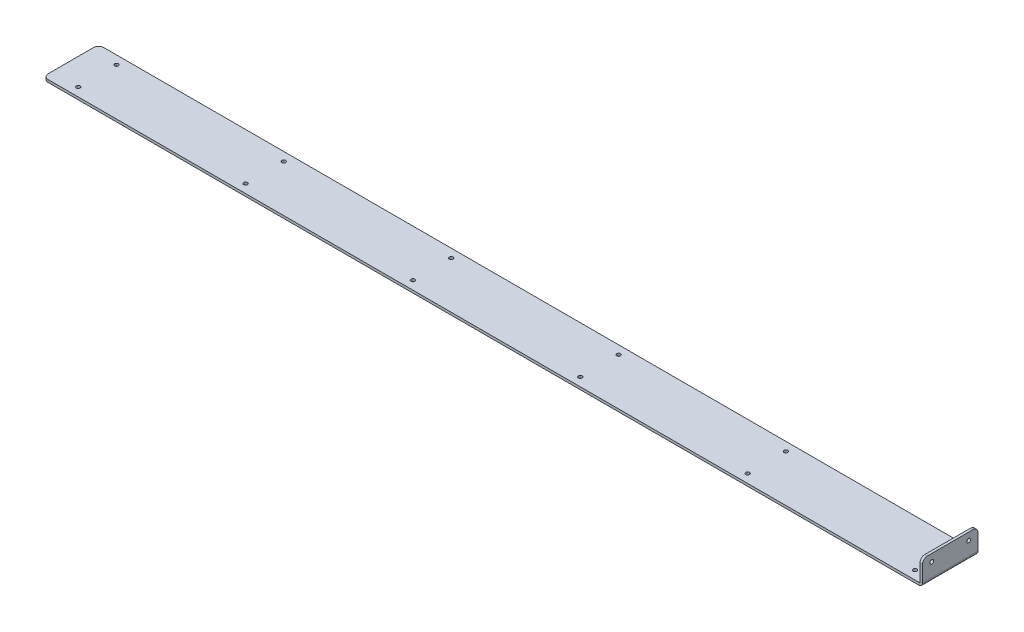
ISO-10303-21;
HEADER;
FILE_DESCRIPTION(('STEP AP214'),'2;1');
FILE_NAME('part.step','',(''),(''),'','','');
FILE_SCHEMA(('AUTOMOTIVE_DESIGN { 1 0 10303 214 1 1 1 1 }'));
ENDSEC;
DATA;
#1=APPLICATION_CONTEXT('core data for automotive mechanical design processes');
#2=APPLICATION_PROTOCOL_DEFINITION('international standard','automotive_design',2000,#1);
#3=PRODUCT_CONTEXT('',#1,'mechanical');
#4=PRODUCT('Part','Part','',(#3));
#5=PRODUCT_RELATED_PRODUCT_CATEGORY('part','',(#4));
#6=PRODUCT_DEFINITION_FORMATION('','',#4);
#7=PRODUCT_DEFINITION_CONTEXT('part definition',#1,'design');
#8=PRODUCT_DEFINITION('design','',#6,#7);
#9=PRODUCT_DEFINITION_SHAPE('','',#8);
#10=(LENGTH_UNIT() NAMED_UNIT(*) SI_UNIT(.MILLI.,.METRE.));
#11=(NAMED_UNIT(*) PLANE_ANGLE_UNIT() SI_UNIT($,.RADIAN.));
#12=(NAMED_UNIT(*) SI_UNIT($,.STERADIAN.) SOLID_ANGLE_UNIT());
#13=UNCERTAINTY_MEASURE_WITH_UNIT(LENGTH_MEASURE(1.E-05),#10,'distance_accuracy_value','');
#14=(GEOMETRIC_REPRESENTATION_CONTEXT(3) GLOBAL_UNCERTAINTY_ASSIGNED_CONTEXT((#13)) GLOBAL_UNIT_ASSIGNED_CONTEXT((#10,
#11,#12)) REPRESENTATION_CONTEXT('',''));
#15=CARTESIAN_POINT('',(0.,0.,0.));
#16=DIRECTION('',(0.,0.,1.));
#17=DIRECTION('',(1.,0.,0.));
#18=AXIS2_PLACEMENT_3D('',#15,#16,#17);
#19=CARTESIAN_POINT('',(-1092.4286,0.,24.6062500000007));
#20=DIRECTION('',(0.,1.,0.));
#21=DIRECTION('',(0.,0.,1.));
#22=AXIS2_PLACEMENT_3D('',#19,#20,#21);
#23=CYLINDRICAL_SURFACE('',#22,2.45744999999999);
#24=CARTESIAN_POINT('',(-1092.4286,-3.2639,24.6062500000007));
#25=DIRECTION('',(0.,1.,0.));
#26=DIRECTION('',(0.,0.,1.));
#27=AXIS2_PLACEMENT_3D('',#24,#25,#26);
#28=CIRCLE('',#27,2.45744999999999);
#29=CARTESIAN_POINT('',(-1092.4286,-3.2639,27.0637000000007));
#30=VERTEX_POINT('',#29);
#31=EDGE_CURVE('E274',#30,#30,#28,.T.);
#32=ORIENTED_EDGE('',*,*,#31,.F.);
#33=EDGE_LOOP('',(#32));
#34=FACE_BOUND('',#33,.T.);
#35=CARTESIAN_POINT('',(-1092.4286,0.,24.6062500000007));
#36=DIRECTION('',(0.,1.,0.));
#37=DIRECTION('',(0.,0.,1.));
#38=AXIS2_PLACEMENT_3D('',#35,#36,#37);
#39=CIRCLE('',#38,2.45744999999999);
#40=CARTESIAN_POINT('',(-1092.4286,0.,27.0637000000006));
#41=VERTEX_POINT('',#40);
#42=EDGE_CURVE('E277',#41,#41,#39,.T.);
#43=ORIENTED_EDGE('',*,*,#42,.T.);
#44=EDGE_LOOP('',(#43));
#45=FACE_BOUND('',#44,.T.);
#46=ADVANCED_FACE('F58',(#34,#45),#23,.F.);
#47=CARTESIAN_POINT('',(-877.1636,0.,24.6062500000005));
#48=DIRECTION('',(0.,1.,0.));
#49=DIRECTION('',(0.,0.,1.));
#50=AXIS2_PLACEMENT_3D('',#47,#48,#49);
#51=CYLINDRICAL_SURFACE('',#50,2.45744999999999);
#52=CARTESIAN_POINT('',(-877.1636,-3.2639,24.6062500000005));
#53=DIRECTION('',(0.,1.,0.));
#54=DIRECTION('',(0.,0.,1.));
#55=AXIS2_PLACEMENT_3D('',#52,#53,#54);
#56=CIRCLE('',#55,2.45744999999999);
#57=CARTESIAN_POINT('',(-877.1636,-3.2639,27.0637000000005));
#58=VERTEX_POINT('',#57);
#59=EDGE_CURVE('E268',#58,#58,#56,.T.);
#60=ORIENTED_EDGE('',*,*,#59,.F.);
#61=EDGE_LOOP('',(#60));
#62=FACE_BOUND('',#61,.T.);
#63=CARTESIAN_POINT('',(-877.1636,0.,24.6062500000005));
#64=DIRECTION('',(0.,1.,0.));
#65=DIRECTION('',(0.,0.,1.));
#66=AXIS2_PLACEMENT_3D('',#63,#64,#65);
#67=CIRCLE('',#66,2.45744999999999);
#68=CARTESIAN_POINT('',(-877.1636,0.,27.0637000000005));
#69=VERTEX_POINT('',#68);
#70=EDGE_CURVE('E271',#69,#69,#67,.T.);
#71=ORIENTED_EDGE('',*,*,#70,.T.);
#72=EDGE_LOOP('',(#71));
#73=FACE_BOUND('',#72,.T.);
#74=ADVANCED_FACE('F361',(#62,#73),#51,.F.);
#75=CARTESIAN_POINT('',(-661.8986,0.,24.6062500000004));
#76=DIRECTION('',(0.,1.,0.));
#77=DIRECTION('',(0.,0.,1.));
#78=AXIS2_PLACEMENT_3D('',#75,#76,#77);
#79=CYLINDRICAL_SURFACE('',#78,2.45744999999999);
#80=CARTESIAN_POINT('',(-661.8986,-3.2639,24.6062500000004));
#81=DIRECTION('',(0.,1.,0.));
#82=DIRECTION('',(0.,0.,1.));
#83=AXIS2_PLACEMENT_3D('',#80,#81,#82);
#84=CIRCLE('',#83,2.45744999999999);
#85=CARTESIAN_POINT('',(-661.8986,-3.2639,27.0637000000004));
#86=VERTEX_POINT('',#85);
#87=EDGE_CURVE('E262',#86,#86,#84,.T.);
#88=ORIENTED_EDGE('',*,*,#87,.F.);
#89=EDGE_LOOP('',(#88));
#90=FACE_BOUND('',#89,.T.);
#91=CARTESIAN_POINT('',(-661.8986,0.,24.6062500000004));
#92=DIRECTION('',(0.,1.,0.));
#93=DIRECTION('',(0.,0.,1.));
#94=AXIS2_PLACEMENT_3D('',#91,#92,#93);
#95=CIRCLE('',#94,2.45744999999999);
#96=CARTESIAN_POINT('',(-661.8986,0.,27.0637000000004));
#97=VERTEX_POINT('',#96);
#98=EDGE_CURVE('E265',#97,#97,#95,.T.);
#99=ORIENTED_EDGE('',*,*,#98,.T.);
#100=EDGE_LOOP('',(#99));
#101=FACE_BOUND('',#100,.T.);
#102=ADVANCED_FACE('F366',(#90,#101),#79,.F.);
#103=CARTESIAN_POINT('',(-446.6336,0.,24.6062500000003));
#104=DIRECTION('',(0.,1.,0.));
#105=DIRECTION('',(0.,0.,1.));
#106=AXIS2_PLACEMENT_3D('',#103,#104,#105);
#107=CYLINDRICAL_SURFACE('',#106,2.45744999999999);
#108=CARTESIAN_POINT('',(-446.6336,-3.2639,24.6062500000003));
#109=DIRECTION('',(0.,1.,0.));
#110=DIRECTION('',(0.,0.,1.));
#111=AXIS2_PLACEMENT_3D('',#108,#109,#110);
#112=CIRCLE('',#111,2.45744999999999);
#113=CARTESIAN_POINT('',(-446.6336,-3.2639,27.0637000000003));
#114=VERTEX_POINT('',#113);
#115=EDGE_CURVE('E256',#114,#114,#112,.T.);
#116=ORIENTED_EDGE('',*,*,#115,.F.);
#117=EDGE_LOOP('',(#116));
#118=FACE_BOUND('',#117,.T.);
#119=CARTESIAN_POINT('',(-446.6336,0.,24.6062500000003));
#120=DIRECTION('',(0.,1.,0.));
#121=DIRECTION('',(0.,0.,1.));
#122=AXIS2_PLACEMENT_3D('',#119,#120,#121);
#123=CIRCLE('',#122,2.45744999999999);
#124=CARTESIAN_POINT('',(-446.6336,0.,27.0637000000003));
#125=VERTEX_POINT('',#124);
#126=EDGE_CURVE('E259',#125,#125,#123,.T.);
#127=ORIENTED_EDGE('',*,*,#126,.T.);
#128=EDGE_LOOP('',(#127));
#129=FACE_BOUND('',#128,.T.);
#130=ADVANCED_FACE('F374',(#118,#129),#107,.F.);
#131=CARTESIAN_POINT('',(-1092.4286,0.,-24.6062499999993));
#132=DIRECTION('',(0.,1.,0.));
#133=DIRECTION('',(0.,0.,1.));
#134=AXIS2_PLACEMENT_3D('',#131,#132,#133);
#135=CYLINDRICAL_SURFACE('',#134,2.45744999999999);
#136=CARTESIAN_POINT('',(-1092.4286,-3.2639,-24.6062499999993));
#137=DIRECTION('',(0.,1.,0.));
#138=DIRECTION('',(0.,0.,1.));
#139=AXIS2_PLACEMENT_3D('',#136,#137,#138);
#140=CIRCLE('',#139,2.45744999999999);
#141=CARTESIAN_POINT('',(-1092.4286,-3.2639,-22.1487999999993));
#142=VERTEX_POINT('',#141);
#143=EDGE_CURVE('E250',#142,#142,#140,.T.);
#144=ORIENTED_EDGE('',*,*,#143,.F.);
#145=EDGE_LOOP('',(#144));
#146=FACE_BOUND('',#145,.T.);
#147=CARTESIAN_POINT('',(-1092.4286,0.,-24.6062499999993));
#148=DIRECTION('',(0.,1.,0.));
#149=DIRECTION('',(0.,0.,1.));
#150=AXIS2_PLACEMENT_3D('',#147,#148,#149);
#151=CIRCLE('',#150,2.45744999999999);
#152=CARTESIAN_POINT('',(-1092.4286,0.,-22.1487999999994));
#153=VERTEX_POINT('',#152);
#154=EDGE_CURVE('E253',#153,#153,#151,.T.);
#155=ORIENTED_EDGE('',*,*,#154,.T.);
#156=EDGE_LOOP('',(#155));
#157=FACE_BOUND('',#156,.T.);
#158=ADVANCED_FACE('F378',(#146,#157),#135,.F.);
#159=CARTESIAN_POINT('',(-877.1636,0.,-24.6062499999995));
#160=DIRECTION('',(0.,1.,0.));
#161=DIRECTION('',(0.,0.,1.));
#162=AXIS2_PLACEMENT_3D('',#159,#160,#161);
#163=CYLINDRICAL_SURFACE('',#162,2.45744999999999);
#164=CARTESIAN_POINT('',(-877.1636,-3.2639,-24.6062499999995));
#165=DIRECTION('',(0.,1.,0.));
#166=DIRECTION('',(0.,0.,1.));
#167=AXIS2_PLACEMENT_3D('',#164,#165,#166);
#168=CIRCLE('',#167,2.45744999999999);
#169=CARTESIAN_POINT('',(-877.1636,-3.2639,-22.1487999999995));
#170=VERTEX_POINT('',#169);
#171=EDGE_CURVE('E244',#170,#170,#168,.T.);
#172=ORIENTED_EDGE('',*,*,#171,.F.);
#173=EDGE_LOOP('',(#172));
#174=FACE_BOUND('',#173,.T.);
#175=CARTESIAN_POINT('',(-877.1636,0.,-24.6062499999995));
#176=DIRECTION('',(0.,1.,0.));
#177=DIRECTION('',(0.,0.,1.));
#178=AXIS2_PLACEMENT_3D('',#175,#176,#177);
#179=CIRCLE('',#178,2.45744999999999);
#180=CARTESIAN_POINT('',(-877.1636,0.,-22.1487999999995));
#181=VERTEX_POINT('',#180);
#182=EDGE_CURVE('E247',#181,#181,#179,.T.);
#183=ORIENTED_EDGE('',*,*,#182,.T.);
#184=EDGE_LOOP('',(#183));
#185=FACE_BOUND('',#184,.T.);
#186=ADVANCED_FACE('F382',(#174,#185),#163,.F.);
#187=CARTESIAN_POINT('',(-661.8986,0.,-24.6062499999996));
#188=DIRECTION('',(0.,1.,0.));
#189=DIRECTION('',(0.,0.,1.));
#190=AXIS2_PLACEMENT_3D('',#187,#188,#189);
#191=CYLINDRICAL_SURFACE('',#190,2.45744999999999);
#192=CARTESIAN_POINT('',(-661.8986,-3.2639,-24.6062499999996));
#193=DIRECTION('',(0.,1.,0.));
#194=DIRECTION('',(0.,0.,1.));
#195=AXIS2_PLACEMENT_3D('',#192,#193,#194);
#196=CIRCLE('',#195,2.45744999999999);
#197=CARTESIAN_POINT('',(-661.8986,-3.2639,-22.1487999999996));
#198=VERTEX_POINT('',#197);
#199=EDGE_CURVE('E238',#198,#198,#196,.T.);
#200=ORIENTED_EDGE('',*,*,#199,.F.);
#201=EDGE_LOOP('',(#200));
#202=FACE_BOUND('',#201,.T.);
#203=CARTESIAN_POINT('',(-661.8986,0.,-24.6062499999996));
#204=DIRECTION('',(0.,1.,0.));
#205=DIRECTION('',(0.,0.,1.));
#206=AXIS2_PLACEMENT_3D('',#203,#204,#205);
#207=CIRCLE('',#206,2.45744999999999);
#208=CARTESIAN_POINT('',(-661.8986,0.,-22.1487999999996));
#209=VERTEX_POINT('',#208);
#210=EDGE_CURVE('E241',#209,#209,#207,.T.);
#211=ORIENTED_EDGE('',*,*,#210,.T.);
#212=EDGE_LOOP('',(#211));
#213=FACE_BOUND('',#212,.T.);
#214=ADVANCED_FACE('F386',(#202,#213),#191,.F.);
#215=CARTESIAN_POINT('',(-446.6336,0.,-24.6062499999997));
#216=DIRECTION('',(0.,1.,0.));
#217=DIRECTION('',(0.,0.,1.));
#218=AXIS2_PLACEMENT_3D('',#215,#216,#217);
#219=CYLINDRICAL_SURFACE('',#218,2.45744999999999);
#220=CARTESIAN_POINT('',(-446.6336,-3.2639,-24.6062499999997));
#221=DIRECTION('',(0.,1.,0.));
#222=DIRECTION('',(0.,0.,1.));
#223=AXIS2_PLACEMENT_3D('',#220,#221,#222);
#224=CIRCLE('',#223,2.45744999999999);
#225=CARTESIAN_POINT('',(-446.6336,-3.2639,-22.1487999999997));
#226=VERTEX_POINT('',#225);
#227=EDGE_CURVE('E230',#226,#226,#224,.T.);
#228=ORIENTED_EDGE('',*,*,#227,.F.);
#229=EDGE_LOOP('',(#228));
#230=FACE_BOUND('',#229,.T.);
#231=CARTESIAN_POINT('',(-446.6336,0.,-24.6062499999997));
#232=DIRECTION('',(0.,1.,0.));
#233=DIRECTION('',(0.,0.,1.));
#234=AXIS2_PLACEMENT_3D('',#231,#232,#233);
#235=CIRCLE('',#234,2.45744999999999);
#236=CARTESIAN_POINT('',(-446.6336,0.,-22.1487999999997));
#237=VERTEX_POINT('',#236);
#238=EDGE_CURVE('E235',#237,#237,#235,.T.);
#239=ORIENTED_EDGE('',*,*,#238,.T.);
#240=EDGE_LOOP('',(#239));
#241=FACE_BOUND('',#240,.T.);
#242=ADVANCED_FACE('F390',(#230,#241),#219,.F.);
#243=CARTESIAN_POINT('',(-1126.47095,-3.2639,-35.7187499999993));
#244=DIRECTION('',(-1.,0.,0.));
#245=DIRECTION('',(0.,0.,1.));
#246=AXIS2_PLACEMENT_3D('',#243,#244,#245);
#247=PLANE('',#246);
#248=DIRECTION('',(0.,0.,1.));
#249=VECTOR('',#248,1.);
#250=CARTESIAN_POINT('',(-1126.47095,-3.2639,-35.7187499999993));
#251=LINE('',#250,#249);
#252=CARTESIAN_POINT('',(-1126.47095,-3.2639,-29.3687499999993));
#253=VERTEX_POINT('',#252);
#254=CARTESIAN_POINT('',(-1126.47095,-3.2639,29.36875));
#255=VERTEX_POINT('',#254);
#256=EDGE_CURVE('E210',#253,#255,#251,.T.);
#257=ORIENTED_EDGE('',*,*,#256,.T.);
#258=DIRECTION('',(0.,1.,0.));
#259=VECTOR('',#258,1.);
#260=CARTESIAN_POINT('',(-1126.47095,-3.2639,29.36875));
#261=LINE('',#260,#259);
#262=CARTESIAN_POINT('',(-1126.47095,0.,29.36875));
#263=VERTEX_POINT('',#262);
#264=EDGE_CURVE('E299',#255,#263,#261,.T.);
#265=ORIENTED_EDGE('',*,*,#264,.T.);
#266=DIRECTION('',(0.,0.,1.));
#267=VECTOR('',#266,1.);
#268=CARTESIAN_POINT('',(-1126.47095,0.,-35.7187499999993));
#269=LINE('',#268,#267);
#270=CARTESIAN_POINT('',(-1126.47095,0.,-29.3687499999993));
#271=VERTEX_POINT('',#270);
#272=EDGE_CURVE('E205',#271,#263,#269,.T.);
#273=ORIENTED_EDGE('',*,*,#272,.F.);
#274=DIRECTION('',(0.,1.,0.));
#275=VECTOR('',#274,1.);
#276=CARTESIAN_POINT('',(-1126.47095,-3.2639,-29.3687499999993));
#277=LINE('',#276,#275);
#278=EDGE_CURVE('E297',#271,#253,#277,.F.);
#279=ORIENTED_EDGE('',*,*,#278,.T.);
#280=EDGE_LOOP('',(#257,#265,#273,#279));
#281=FACE_BOUND('',#280,.T.);
#282=ADVANCED_FACE('F313',(#281),#247,.T.);
#283=CARTESIAN_POINT('',(-1126.47095,-3.2639,-35.7187499999993));
#284=DIRECTION('',(0.,0.,-1.));
#285=DIRECTION('',(-1.,0.,0.));
#286=AXIS2_PLACEMENT_3D('',#283,#284,#285);
#287=PLANE('',#286);
#288=DIRECTION('',(-1.,0.,0.));
#289=VECTOR('',#288,1.);
#290=CARTESIAN_POINT('',(-1126.47095,-3.2639,-35.7187499999993));
#291=LINE('',#290,#289);
#292=CARTESIAN_POINT('',(0.,-3.2639,-35.71875));
#293=VERTEX_POINT('',#292);
#294=CARTESIAN_POINT('',(-1120.12095,-3.2639,-35.7187499999993));
#295=VERTEX_POINT('',#294);
#296=EDGE_CURVE('E217',#293,#295,#291,.T.);
#297=ORIENTED_EDGE('',*,*,#296,.T.);
#298=DIRECTION('',(0.,1.,0.));
#299=VECTOR('',#298,1.);
#300=CARTESIAN_POINT('',(-1120.12095,-3.2639,-35.7187499999993));
#301=LINE('',#300,#299);
#302=CARTESIAN_POINT('',(-1120.12095,0.,-35.7187499999993));
#303=VERTEX_POINT('',#302);
#304=EDGE_CURVE('E13',#295,#303,#301,.T.);
#305=ORIENTED_EDGE('',*,*,#304,.T.);
#306=DIRECTION('',(-1.,0.,0.));
#307=VECTOR('',#306,1.);
#308=CARTESIAN_POINT('',(-1126.47095,0.,-35.7187499999993));
#309=LINE('',#308,#307);
#310=CARTESIAN_POINT('',(0.,0.,-35.71875));
#311=VERTEX_POINT('',#310);
#312=EDGE_CURVE('E214',#311,#303,#309,.T.);
#313=ORIENTED_EDGE('',*,*,#312,.F.);
#314=DIRECTION('',(0.,1.,0.));
#315=VECTOR('',#314,1.);
#316=CARTESIAN_POINT('',(0.,-3.2639,-35.71875));
#317=LINE('',#316,#315);
#318=EDGE_CURVE('E228',#293,#311,#317,.T.);
#319=ORIENTED_EDGE('',*,*,#318,.F.);
#320=EDGE_LOOP('',(#297,#305,#313,#319));
#321=FACE_BOUND('',#320,.T.);
#322=ADVANCED_FACE('F397',(#321),#287,.T.);
#323=CARTESIAN_POINT('',(-1126.47095,-3.2639,35.71875));
#324=DIRECTION('',(0.,0.,1.));
#325=DIRECTION('',(1.,0.,0.));
#326=AXIS2_PLACEMENT_3D('',#323,#324,#325);
#327=PLANE('',#326);
#328=DIRECTION('',(1.,0.,0.));
#329=VECTOR('',#328,1.);
#330=CARTESIAN_POINT('',(-1126.47095,0.,35.71875));
#331=LINE('',#330,#329);
#332=CARTESIAN_POINT('',(-1120.12095,0.,35.71875));
#333=VERTEX_POINT('',#332);
#334=CARTESIAN_POINT('',(0.,0.,35.71875));
#335=VERTEX_POINT('',#334);
#336=EDGE_CURVE('E222',#333,#335,#331,.T.);
#337=ORIENTED_EDGE('',*,*,#336,.F.);
#338=DIRECTION('',(0.,1.,0.));
#339=VECTOR('',#338,1.);
#340=CARTESIAN_POINT('',(-1120.12095,-3.2639,35.71875));
#341=LINE('',#340,#339);
#342=CARTESIAN_POINT('',(-1120.12095,-3.2639,35.71875));
#343=VERTEX_POINT('',#342);
#344=EDGE_CURVE('E81',#333,#343,#341,.F.);
#345=ORIENTED_EDGE('',*,*,#344,.T.);
#346=DIRECTION('',(1.,0.,0.));
#347=VECTOR('',#346,1.);
#348=CARTESIAN_POINT('',(-1126.47095,-3.2639,35.71875));
#349=LINE('',#348,#347);
#350=CARTESIAN_POINT('',(0.,-3.2639,35.71875));
#351=VERTEX_POINT('',#350);
#352=EDGE_CURVE('E213',#343,#351,#349,.T.);
#353=ORIENTED_EDGE('',*,*,#352,.T.);
#354=DIRECTION('',(0.,1.,0.));
#355=VECTOR('',#354,1.);
#356=CARTESIAN_POINT('',(0.,-3.2639,35.71875));
#357=LINE('',#356,#355);
#358=EDGE_CURVE('E219',#351,#335,#357,.T.);
#359=ORIENTED_EDGE('',*,*,#358,.T.);
#360=EDGE_LOOP('',(#337,#345,#353,#359));
#361=FACE_BOUND('',#360,.T.);
#362=ADVANCED_FACE('F320',(#361),#327,.T.);
#363=CARTESIAN_POINT('',(0.,-3.2639,0.));
#364=DIRECTION('',(0.,1.,0.));
#365=DIRECTION('',(0.,0.,1.));
#366=AXIS2_PLACEMENT_3D('',#363,#364,#365);
#367=PLANE('',#366);
#368=CARTESIAN_POINT('',(-231.3686,-3.2639,24.6062500000001));
#369=DIRECTION('',(0.,1.,0.));
#370=DIRECTION('',(0.,0.,1.));
#371=AXIS2_PLACEMENT_3D('',#368,#369,#370);
#372=CIRCLE('',#371,2.45744999999999);
#373=CARTESIAN_POINT('',(-231.3686,-3.2639,27.0637000000001));
#374=VERTEX_POINT('',#373);
#375=EDGE_CURVE('E459',#374,#374,#372,.T.);
#376=ORIENTED_EDGE('',*,*,#375,.T.);
#377=EDGE_LOOP('',(#376));
#378=FACE_BOUND('',#377,.T.);
#379=CARTESIAN_POINT('',(-231.3686,-3.2639,-24.6062499999999));
#380=DIRECTION('',(0.,1.,0.));
#381=DIRECTION('',(0.,0.,1.));
#382=AXIS2_PLACEMENT_3D('',#379,#380,#381);
#383=CIRCLE('',#382,2.45744999999999);
#384=CARTESIAN_POINT('',(-231.3686,-3.2639,-22.1487999999999));
#385=VERTEX_POINT('',#384);
#386=EDGE_CURVE('E471',#385,#385,#383,.T.);
#387=ORIENTED_EDGE('',*,*,#386,.T.);
#388=EDGE_LOOP('',(#387));
#389=FACE_BOUND('',#388,.T.);
#390=CARTESIAN_POINT('',(-16.1035999999999,-3.2639,-24.60625));
#391=DIRECTION('',(0.,1.,0.));
#392=DIRECTION('',(0.,0.,1.));
#393=AXIS2_PLACEMENT_3D('',#390,#391,#392);
#394=CIRCLE('',#393,2.45744999999999);
#395=CARTESIAN_POINT('',(-16.1035999999999,-3.2639,-22.1488));
#396=VERTEX_POINT('',#395);
#397=EDGE_CURVE('E480',#396,#396,#394,.T.);
#398=ORIENTED_EDGE('',*,*,#397,.T.);
#399=EDGE_LOOP('',(#398));
#400=FACE_BOUND('',#399,.T.);
#401=CARTESIAN_POINT('',(-16.1035999999999,-3.2639,24.60625));
#402=DIRECTION('',(0.,1.,0.));
#403=DIRECTION('',(0.,0.,1.));
#404=AXIS2_PLACEMENT_3D('',#401,#402,#403);
#405=CIRCLE('',#404,2.45744999999999);
#406=CARTESIAN_POINT('',(-16.1035999999999,-3.2639,27.0637));
#407=VERTEX_POINT('',#406);
#408=EDGE_CURVE('E204',#407,#407,#405,.T.);
#409=ORIENTED_EDGE('',*,*,#408,.T.);
#410=EDGE_LOOP('',(#409));
#411=FACE_BOUND('',#410,.T.);
#412=ORIENTED_EDGE('',*,*,#352,.F.);
#413=CARTESIAN_POINT('',(-1120.12095,-3.2639,29.36875));
#414=DIRECTION('',(0.,1.,0.));
#415=DIRECTION('',(0.,0.,1.));
#416=AXIS2_PLACEMENT_3D('',#413,#414,#415);
#417=CIRCLE('',#416,6.35);
#418=EDGE_CURVE('E66',#343,#255,#417,.F.);
#419=ORIENTED_EDGE('',*,*,#418,.T.);
#420=ORIENTED_EDGE('',*,*,#256,.F.);
#421=CARTESIAN_POINT('',(-1120.12095,-3.2639,-29.3687499999993));
#422=DIRECTION('',(0.,1.,0.));
#423=DIRECTION('',(0.,0.,1.));
#424=AXIS2_PLACEMENT_3D('',#421,#422,#423);
#425=CIRCLE('',#424,6.35);
#426=EDGE_CURVE('E73',#253,#295,#425,.F.);
#427=ORIENTED_EDGE('',*,*,#426,.T.);
#428=ORIENTED_EDGE('',*,*,#296,.F.);
#429=DIRECTION('',(0.,0.,-1.));
#430=VECTOR('',#429,1.);
#431=CARTESIAN_POINT('',(0.,-3.2639,-35.71875));
#432=LINE('',#431,#430);
#433=EDGE_CURVE('E158',#351,#293,#432,.T.);
#434=ORIENTED_EDGE('',*,*,#433,.F.);
#435=EDGE_LOOP('',(#412,#419,#420,#427,#428,#434));
#436=FACE_BOUND('',#435,.T.);
#437=ORIENTED_EDGE('',*,*,#227,.T.);
#438=EDGE_LOOP('',(#437));
#439=FACE_BOUND('',#438,.T.);
#440=ORIENTED_EDGE('',*,*,#199,.T.);
#441=EDGE_LOOP('',(#440));
#442=FACE_BOUND('',#441,.T.);
#443=ORIENTED_EDGE('',*,*,#171,.T.);
#444=EDGE_LOOP('',(#443));
#445=FACE_BOUND('',#444,.T.);
#446=ORIENTED_EDGE('',*,*,#143,.T.);
#447=EDGE_LOOP('',(#446));
#448=FACE_BOUND('',#447,.T.);
#449=ORIENTED_EDGE('',*,*,#115,.T.);
#450=EDGE_LOOP('',(#449));
#451=FACE_BOUND('',#450,.T.);
#452=ORIENTED_EDGE('',*,*,#87,.T.);
#453=EDGE_LOOP('',(#452));
#454=FACE_BOUND('',#453,.T.);
#455=ORIENTED_EDGE('',*,*,#59,.T.);
#456=EDGE_LOOP('',(#455));
#457=FACE_BOUND('',#456,.T.);
#458=ORIENTED_EDGE('',*,*,#31,.T.);
#459=EDGE_LOOP('',(#458));
#460=FACE_BOUND('',#459,.T.);
#461=ADVANCED_FACE('F308',(#378,#389,#400,#411,#436,#439,#442,#445,#448,#451,#454,#457,#460),
#367,.F.);
#462=CARTESIAN_POINT('',(0.,0.,0.));
#463=DIRECTION('',(0.,1.,0.));
#464=DIRECTION('',(0.,0.,1.));
#465=AXIS2_PLACEMENT_3D('',#462,#463,#464);
#466=PLANE('',#465);
#467=CARTESIAN_POINT('',(-231.3686,0.,24.6062500000001));
#468=DIRECTION('',(0.,1.,0.));
#469=DIRECTION('',(0.,0.,1.));
#470=AXIS2_PLACEMENT_3D('',#467,#468,#469);
#471=CIRCLE('',#470,2.45744999999999);
#472=CARTESIAN_POINT('',(-231.3686,0.,27.0637000000001));
#473=VERTEX_POINT('',#472);
#474=EDGE_CURVE('E468',#473,#473,#471,.T.);
#475=ORIENTED_EDGE('',*,*,#474,.F.);
#476=EDGE_LOOP('',(#475));
#477=FACE_BOUND('',#476,.T.);
#478=CARTESIAN_POINT('',(-231.3686,0.,-24.6062499999999));
#479=DIRECTION('',(0.,1.,0.));
#480=DIRECTION('',(0.,0.,1.));
#481=AXIS2_PLACEMENT_3D('',#478,#479,#480);
#482=CIRCLE('',#481,2.45744999999999);
#483=CARTESIAN_POINT('',(-231.3686,0.,-22.1487999999999));
#484=VERTEX_POINT('',#483);
#485=EDGE_CURVE('E474',#484,#484,#482,.T.);
#486=ORIENTED_EDGE('',*,*,#485,.F.);
#487=EDGE_LOOP('',(#486));
#488=FACE_BOUND('',#487,.T.);
#489=CARTESIAN_POINT('',(-16.1035999999999,0.,-24.60625));
#490=DIRECTION('',(0.,1.,0.));
#491=DIRECTION('',(0.,0.,1.));
#492=AXIS2_PLACEMENT_3D('',#489,#490,#491);
#493=CIRCLE('',#492,2.45744999999999);
#494=CARTESIAN_POINT('',(-16.1035999999999,0.,-22.1488));
#495=VERTEX_POINT('',#494);
#496=EDGE_CURVE('E477',#495,#495,#493,.T.);
#497=ORIENTED_EDGE('',*,*,#496,.F.);
#498=EDGE_LOOP('',(#497));
#499=FACE_BOUND('',#498,.T.);
#500=CARTESIAN_POINT('',(-16.1035999999999,0.,24.60625));
#501=DIRECTION('',(0.,1.,0.));
#502=DIRECTION('',(0.,0.,1.));
#503=AXIS2_PLACEMENT_3D('',#500,#501,#502);
#504=CIRCLE('',#503,2.45744999999999);
#505=CARTESIAN_POINT('',(-16.1035999999999,0.,27.0637));
#506=VERTEX_POINT('',#505);
#507=EDGE_CURVE('E483',#506,#506,#504,.T.);
#508=ORIENTED_EDGE('',*,*,#507,.F.);
#509=EDGE_LOOP('',(#508));
#510=FACE_BOUND('',#509,.T.);
#511=ORIENTED_EDGE('',*,*,#272,.T.);
#512=CARTESIAN_POINT('',(-1120.12095,0.,29.36875));
#513=DIRECTION('',(0.,1.,0.));
#514=DIRECTION('',(0.,0.,1.));
#515=AXIS2_PLACEMENT_3D('',#512,#513,#514);
#516=CIRCLE('',#515,6.35);
#517=EDGE_CURVE('E304',#263,#333,#516,.T.);
#518=ORIENTED_EDGE('',*,*,#517,.T.);
#519=ORIENTED_EDGE('',*,*,#336,.T.);
#520=DIRECTION('',(0.,0.,-1.));
#521=VECTOR('',#520,1.);
#522=CARTESIAN_POINT('',(0.,0.,-35.71875));
#523=LINE('',#522,#521);
#524=EDGE_CURVE('E224',#335,#311,#523,.T.);
#525=ORIENTED_EDGE('',*,*,#524,.T.);
#526=ORIENTED_EDGE('',*,*,#312,.T.);
#527=CARTESIAN_POINT('',(-1120.12095,0.,-29.3687499999993));
#528=DIRECTION('',(0.,1.,0.));
#529=DIRECTION('',(0.,0.,1.));
#530=AXIS2_PLACEMENT_3D('',#527,#528,#529);
#531=CIRCLE('',#530,6.35);
#532=EDGE_CURVE('E302',#303,#271,#531,.T.);
#533=ORIENTED_EDGE('',*,*,#532,.T.);
#534=EDGE_LOOP('',(#511,#518,#519,#525,#526,#533));
#535=FACE_BOUND('',#534,.T.);
#536=ORIENTED_EDGE('',*,*,#238,.F.);
#537=EDGE_LOOP('',(#536));
#538=FACE_BOUND('',#537,.T.);
#539=ORIENTED_EDGE('',*,*,#210,.F.);
#540=EDGE_LOOP('',(#539));
#541=FACE_BOUND('',#540,.T.);
#542=ORIENTED_EDGE('',*,*,#182,.F.);
#543=EDGE_LOOP('',(#542));
#544=FACE_BOUND('',#543,.T.);
#545=ORIENTED_EDGE('',*,*,#154,.F.);
#546=EDGE_LOOP('',(#545));
#547=FACE_BOUND('',#546,.T.);
#548=ORIENTED_EDGE('',*,*,#126,.F.);
#549=EDGE_LOOP('',(#548));
#550=FACE_BOUND('',#549,.T.);
#551=ORIENTED_EDGE('',*,*,#98,.F.);
#552=EDGE_LOOP('',(#551));
#553=FACE_BOUND('',#552,.T.);
#554=ORIENTED_EDGE('',*,*,#70,.F.);
#555=EDGE_LOOP('',(#554));
#556=FACE_BOUND('',#555,.T.);
#557=ORIENTED_EDGE('',*,*,#42,.F.);
#558=EDGE_LOOP('',(#557));
#559=FACE_BOUND('',#558,.T.);
#560=ADVANCED_FACE('F318',(#477,#488,#499,#510,#535,#538,#541,#544,#547,#550,#553,#556,#559),
#466,.T.);
#561=CARTESIAN_POINT('',(0.,1.27,35.71875));
#562=DIRECTION('',(0.,0.,1.));
#563=DIRECTION('',(1.,0.,0.));
#564=AXIS2_PLACEMENT_3D('',#561,#562,#563);
#565=PLANE('',#564);
#566=DIRECTION('',(-1.,0.,0.));
#567=VECTOR('',#566,1.);
#568=CARTESIAN_POINT('',(4.53390000000001,1.26999999999998,35.71875));
#569=LINE('',#568,#567);
#570=CARTESIAN_POINT('',(1.27000000000001,1.27,35.71875));
#571=VERTEX_POINT('',#570);
#572=CARTESIAN_POINT('',(4.53390000000001,1.26999999999998,35.71875));
#573=VERTEX_POINT('',#572);
#574=EDGE_CURVE('E201',#571,#573,#569,.F.);
#575=ORIENTED_EDGE('',*,*,#574,.F.);
#576=CARTESIAN_POINT('',(0.,1.27,35.71875));
#577=DIRECTION('',(0.,0.,-1.));
#578=DIRECTION('',(-1.,0.,0.));
#579=AXIS2_PLACEMENT_3D('',#576,#577,#578);
#580=CIRCLE('',#579,1.27);
#581=EDGE_CURVE('E162',#335,#571,#580,.F.);
#582=ORIENTED_EDGE('',*,*,#581,.F.);
#583=ORIENTED_EDGE('',*,*,#358,.F.);
#584=CARTESIAN_POINT('',(0.,1.27,35.71875));
#585=DIRECTION('',(0.,0.,-1.));
#586=DIRECTION('',(-1.,0.,0.));
#587=AXIS2_PLACEMENT_3D('',#584,#585,#586);
#588=CIRCLE('',#587,4.5339);
#589=EDGE_CURVE('E161',#351,#573,#588,.F.);
#590=ORIENTED_EDGE('',*,*,#589,.T.);
#591=EDGE_LOOP('',(#575,#582,#583,#590));
#592=FACE_BOUND('',#591,.T.);
#593=ADVANCED_FACE('F330',(#592),#565,.T.);
#594=CARTESIAN_POINT('',(0.,1.27,-35.71875));
#595=DIRECTION('',(0.,0.,1.));
#596=DIRECTION('',(1.,0.,0.));
#597=AXIS2_PLACEMENT_3D('',#594,#595,#596);
#598=PLANE('',#597);
#599=CARTESIAN_POINT('',(0.,1.27,-35.71875));
#600=DIRECTION('',(0.,0.,-1.));
#601=DIRECTION('',(-1.,0.,0.));
#602=AXIS2_PLACEMENT_3D('',#599,#600,#601);
#603=CIRCLE('',#602,1.27);
#604=CARTESIAN_POINT('',(1.26999999999999,1.27,-35.71875));
#605=VERTEX_POINT('',#604);
#606=EDGE_CURVE('E169',#605,#311,#603,.T.);
#607=ORIENTED_EDGE('',*,*,#606,.F.);
#608=DIRECTION('',(-1.,0.,0.));
#609=VECTOR('',#608,1.);
#610=CARTESIAN_POINT('',(1.26999999999999,1.27,-35.71875));
#611=LINE('',#610,#609);
#612=CARTESIAN_POINT('',(4.53389999999999,1.26999999999998,-35.71875));
#613=VERTEX_POINT('',#612);
#614=EDGE_CURVE('E166',#605,#613,#611,.F.);
#615=ORIENTED_EDGE('',*,*,#614,.T.);
#616=CARTESIAN_POINT('',(0.,1.27,-35.71875));
#617=DIRECTION('',(0.,0.,-1.));
#618=DIRECTION('',(-1.,0.,0.));
#619=AXIS2_PLACEMENT_3D('',#616,#617,#618);
#620=CIRCLE('',#619,4.5339);
#621=EDGE_CURVE('E150',#613,#293,#620,.T.);
#622=ORIENTED_EDGE('',*,*,#621,.T.);
#623=ORIENTED_EDGE('',*,*,#318,.T.);
#624=EDGE_LOOP('',(#607,#615,#622,#623));
#625=FACE_BOUND('',#624,.T.);
#626=ADVANCED_FACE('F167',(#625),#598,.F.);
#627=CARTESIAN_POINT('',(0.,1.27,-35.71875));
#628=DIRECTION('',(0.,0.,-1.));
#629=DIRECTION('',(1.,0.,0.));
#630=AXIS2_PLACEMENT_3D('',#627,#628,#629);
#631=CYLINDRICAL_SURFACE('',#630,4.5339);
#632=ORIENTED_EDGE('',*,*,#433,.T.);
#633=ORIENTED_EDGE('',*,*,#621,.F.);
#634=DIRECTION('',(0.,0.,-1.));
#635=VECTOR('',#634,1.);
#636=CARTESIAN_POINT('',(4.53390000000001,1.26999999999998,35.71875));
#637=LINE('',#636,#635);
#638=EDGE_CURVE('E155',#613,#573,#637,.F.);
#639=ORIENTED_EDGE('',*,*,#638,.T.);
#640=ORIENTED_EDGE('',*,*,#589,.F.);
#641=EDGE_LOOP('',(#632,#633,#639,#640));
#642=FACE_BOUND('',#641,.T.);
#643=ADVANCED_FACE('F152',(#642),#631,.T.);
#644=CARTESIAN_POINT('',(0.,1.27,-35.71875));
#645=DIRECTION('',(0.,0.,-1.));
#646=DIRECTION('',(1.,0.,0.));
#647=AXIS2_PLACEMENT_3D('',#644,#645,#646);
#648=CYLINDRICAL_SURFACE('',#647,1.27);
#649=ORIENTED_EDGE('',*,*,#524,.F.);
#650=ORIENTED_EDGE('',*,*,#581,.T.);
#651=DIRECTION('',(0.,0.,-1.));
#652=VECTOR('',#651,1.);
#653=CARTESIAN_POINT('',(1.27000000000001,1.27,35.71875));
#654=LINE('',#653,#652);
#655=EDGE_CURVE('E174',#571,#605,#654,.T.);
#656=ORIENTED_EDGE('',*,*,#655,.T.);
#657=ORIENTED_EDGE('',*,*,#606,.T.);
#658=EDGE_LOOP('',(#649,#650,#656,#657));
#659=FACE_BOUND('',#658,.T.);
#660=ADVANCED_FACE('F326',(#659),#648,.F.);
#661=CARTESIAN_POINT('',(4.53390000000008,28.4861,-35.71875));
#662=DIRECTION('',(0.,0.,1.));
#663=DIRECTION('',(1.,0.,0.));
#664=AXIS2_PLACEMENT_3D('',#661,#662,#663);
#665=PLANE('',#664);
#666=DIRECTION('',(0.,-1.,0.));
#667=VECTOR('',#666,1.);
#668=CARTESIAN_POINT('',(1.27000000000008,28.4861,-35.71875));
#669=LINE('',#668,#667);
#670=CARTESIAN_POINT('',(1.27000000000006,22.1361,-35.71875));
#671=VERTEX_POINT('',#670);
#672=EDGE_CURVE('E184',#605,#671,#669,.F.);
#673=ORIENTED_EDGE('',*,*,#672,.T.);
#674=DIRECTION('',(-1.,0.,0.));
#675=VECTOR('',#674,1.);
#676=CARTESIAN_POINT('',(4.53390000000006,22.1361,-35.71875));
#677=LINE('',#676,#675);
#678=CARTESIAN_POINT('',(4.53390000000006,22.1361,-35.71875));
#679=VERTEX_POINT('',#678);
#680=EDGE_CURVE('E188',#671,#679,#677,.F.);
#681=ORIENTED_EDGE('',*,*,#680,.T.);
#682=DIRECTION('',(0.,1.,0.));
#683=VECTOR('',#682,1.);
#684=CARTESIAN_POINT('',(4.53389999999998,0.,-35.71875));
#685=LINE('',#684,#683);
#686=EDGE_CURVE('E180',#613,#679,#685,.T.);
#687=ORIENTED_EDGE('',*,*,#686,.F.);
#688=ORIENTED_EDGE('',*,*,#614,.F.);
#689=EDGE_LOOP('',(#673,#681,#687,#688));
#690=FACE_BOUND('',#689,.T.);
#691=ADVANCED_FACE('F186',(#690),#665,.F.);
#692=CARTESIAN_POINT('',(4.53390000000001,0.,35.71875));
#693=DIRECTION('',(0.,0.,-1.));
#694=DIRECTION('',(-1.,0.,0.));
#695=AXIS2_PLACEMENT_3D('',#692,#693,#694);
#696=PLANE('',#695);
#697=DIRECTION('',(0.,-1.,0.));
#698=VECTOR('',#697,1.);
#699=CARTESIAN_POINT('',(4.53390000000001,0.,35.71875));
#700=LINE('',#699,#698);
#701=CARTESIAN_POINT('',(4.53390000000008,22.1361,35.71875));
#702=VERTEX_POINT('',#701);
#703=EDGE_CURVE('E183',#702,#573,#700,.T.);
#704=ORIENTED_EDGE('',*,*,#703,.F.);
#705=DIRECTION('',(-1.,0.,0.));
#706=VECTOR('',#705,1.);
#707=CARTESIAN_POINT('',(4.53390000000008,22.1361,35.71875));
#708=LINE('',#707,#706);
#709=CARTESIAN_POINT('',(1.27000000000008,22.1361,35.71875));
#710=VERTEX_POINT('',#709);
#711=EDGE_CURVE('E280',#702,#710,#708,.T.);
#712=ORIENTED_EDGE('',*,*,#711,.T.);
#713=DIRECTION('',(0.,1.,0.));
#714=VECTOR('',#713,1.);
#715=CARTESIAN_POINT('',(1.27000000000001,0.,35.71875));
#716=LINE('',#715,#714);
#717=EDGE_CURVE('E190',#710,#571,#716,.F.);
#718=ORIENTED_EDGE('',*,*,#717,.T.);
#719=ORIENTED_EDGE('',*,*,#574,.T.);
#720=EDGE_LOOP('',(#704,#712,#718,#719));
#721=FACE_BOUND('',#720,.T.);
#722=ADVANCED_FACE('F332',(#721),#696,.F.);
#723=CARTESIAN_POINT('',(4.5339,0.,0.));
#724=DIRECTION('',(-1.,0.,0.));
#725=DIRECTION('',(0.,-1.,0.));
#726=AXIS2_PLACEMENT_3D('',#723,#724,#725);
#727=PLANE('',#726);
#728=CARTESIAN_POINT('',(4.53390000000005,19.0499999999961,-23.8125));
#729=DIRECTION('',(-1.,0.,0.));
#730=DIRECTION('',(0.,-1.,0.));
#731=AXIS2_PLACEMENT_3D('',#728,#729,#730);
#732=CIRCLE('',#731,2.45744999999999);
#733=CARTESIAN_POINT('',(4.53390000000005,16.5925499999961,-23.8125));
#734=VERTEX_POINT('',#733);
#735=EDGE_CURVE('E457',#734,#734,#732,.T.);
#736=ORIENTED_EDGE('',*,*,#735,.T.);
#737=EDGE_LOOP('',(#736));
#738=FACE_BOUND('',#737,.T.);
#739=CARTESIAN_POINT('',(4.53390000000007,19.0499999999961,23.8125));
#740=DIRECTION('',(-1.,0.,0.));
#741=DIRECTION('',(0.,-1.,0.));
#742=AXIS2_PLACEMENT_3D('',#739,#740,#741);
#743=CIRCLE('',#742,2.45744999999999);
#744=CARTESIAN_POINT('',(4.53390000000006,16.5925499999961,23.8125));
#745=VERTEX_POINT('',#744);
#746=EDGE_CURVE('E452',#745,#745,#743,.T.);
#747=ORIENTED_EDGE('',*,*,#746,.T.);
#748=EDGE_LOOP('',(#747));
#749=FACE_BOUND('',#748,.T.);
#750=DIRECTION('',(0.,0.,1.));
#751=VECTOR('',#750,1.);
#752=CARTESIAN_POINT('',(4.5339000000001,28.4861,0.));
#753=LINE('',#752,#751);
#754=CARTESIAN_POINT('',(4.53390000000009,28.4861,-29.36875));
#755=VERTEX_POINT('',#754);
#756=CARTESIAN_POINT('',(4.5339000000001,28.4861,29.36875));
#757=VERTEX_POINT('',#756);
#758=EDGE_CURVE('E189',#755,#757,#753,.T.);
#759=ORIENTED_EDGE('',*,*,#758,.T.);
#760=CARTESIAN_POINT('',(4.53390000000008,22.1361,29.36875));
#761=DIRECTION('',(-1.,0.,0.));
#762=DIRECTION('',(0.,-1.,0.));
#763=AXIS2_PLACEMENT_3D('',#760,#761,#762);
#764=CIRCLE('',#763,6.35);
#765=EDGE_CURVE('E294',#757,#702,#764,.F.);
#766=ORIENTED_EDGE('',*,*,#765,.T.);
#767=ORIENTED_EDGE('',*,*,#703,.T.);
#768=ORIENTED_EDGE('',*,*,#638,.F.);
#769=ORIENTED_EDGE('',*,*,#686,.T.);
#770=CARTESIAN_POINT('',(4.53390000000006,22.1361,-29.36875));
#771=DIRECTION('',(-1.,0.,0.));
#772=DIRECTION('',(0.,-1.,0.));
#773=AXIS2_PLACEMENT_3D('',#770,#771,#772);
#774=CIRCLE('',#773,6.35);
#775=EDGE_CURVE('E292',#679,#755,#774,.F.);
#776=ORIENTED_EDGE('',*,*,#775,.T.);
#777=EDGE_LOOP('',(#759,#766,#767,#768,#769,#776));
#778=FACE_BOUND('',#777,.T.);
#779=ADVANCED_FACE('F179',(#738,#749,#778),#727,.F.);
#780=CARTESIAN_POINT('',(1.27,0.,0.));
#781=DIRECTION('',(-1.,0.,0.));
#782=DIRECTION('',(0.,-1.,0.));
#783=AXIS2_PLACEMENT_3D('',#780,#781,#782);
#784=PLANE('',#783);
#785=CARTESIAN_POINT('',(1.27000000000005,19.0499999999961,-23.8125));
#786=DIRECTION('',(-1.,0.,0.));
#787=DIRECTION('',(0.,0.,1.));
#788=AXIS2_PLACEMENT_3D('',#785,#786,#787);
#789=CIRCLE('',#788,2.45744999999999);
#790=CARTESIAN_POINT('',(1.27000000000005,19.0499999999961,-21.35505));
#791=VERTEX_POINT('',#790);
#792=EDGE_CURVE('E462',#791,#791,#789,.T.);
#793=ORIENTED_EDGE('',*,*,#792,.F.);
#794=EDGE_LOOP('',(#793));
#795=FACE_BOUND('',#794,.T.);
#796=CARTESIAN_POINT('',(1.27000000000007,19.0499999999961,23.8125));
#797=DIRECTION('',(-1.,0.,0.));
#798=DIRECTION('',(0.,0.,1.));
#799=AXIS2_PLACEMENT_3D('',#796,#797,#798);
#800=CIRCLE('',#799,2.45744999999999);
#801=CARTESIAN_POINT('',(1.27000000000007,19.0499999999961,26.26995));
#802=VERTEX_POINT('',#801);
#803=EDGE_CURVE('E455',#802,#802,#800,.T.);
#804=ORIENTED_EDGE('',*,*,#803,.F.);
#805=EDGE_LOOP('',(#804));
#806=FACE_BOUND('',#805,.T.);
#807=ORIENTED_EDGE('',*,*,#717,.F.);
#808=CARTESIAN_POINT('',(1.27000000000008,22.1361,29.36875));
#809=DIRECTION('',(-1.,0.,0.));
#810=DIRECTION('',(0.,-1.,0.));
#811=AXIS2_PLACEMENT_3D('',#808,#809,#810);
#812=CIRCLE('',#811,6.35);
#813=CARTESIAN_POINT('',(1.2700000000001,28.4861,29.36875));
#814=VERTEX_POINT('',#813);
#815=EDGE_CURVE('E285',#710,#814,#812,.T.);
#816=ORIENTED_EDGE('',*,*,#815,.T.);
#817=DIRECTION('',(0.,0.,-1.));
#818=VECTOR('',#817,1.);
#819=CARTESIAN_POINT('',(1.27000000000011,28.4861,35.71875));
#820=LINE('',#819,#818);
#821=CARTESIAN_POINT('',(1.27000000000009,28.4861,-29.36875));
#822=VERTEX_POINT('',#821);
#823=EDGE_CURVE('E193',#822,#814,#820,.F.);
#824=ORIENTED_EDGE('',*,*,#823,.F.);
#825=CARTESIAN_POINT('',(1.27000000000006,22.1361,-29.36875));
#826=DIRECTION('',(-1.,0.,0.));
#827=DIRECTION('',(0.,-1.,0.));
#828=AXIS2_PLACEMENT_3D('',#825,#826,#827);
#829=CIRCLE('',#828,6.35);
#830=EDGE_CURVE('E283',#822,#671,#829,.T.);
#831=ORIENTED_EDGE('',*,*,#830,.T.);
#832=ORIENTED_EDGE('',*,*,#672,.F.);
#833=ORIENTED_EDGE('',*,*,#655,.F.);
#834=EDGE_LOOP('',(#807,#816,#824,#831,#832,#833));
#835=FACE_BOUND('',#834,.T.);
#836=ADVANCED_FACE('F336',(#795,#806,#835),#784,.T.);
#837=CARTESIAN_POINT('',(4.53390000000011,28.4861,35.71875));
#838=DIRECTION('',(0.,-1.,0.));
#839=DIRECTION('',(1.,0.,0.));
#840=AXIS2_PLACEMENT_3D('',#837,#838,#839);
#841=PLANE('',#840);
#842=ORIENTED_EDGE('',*,*,#823,.T.);
#843=DIRECTION('',(-1.,0.,0.));
#844=VECTOR('',#843,1.);
#845=CARTESIAN_POINT('',(4.5339000000001,28.4861,29.36875));
#846=LINE('',#845,#844);
#847=EDGE_CURVE('E290',#814,#757,#846,.F.);
#848=ORIENTED_EDGE('',*,*,#847,.T.);
#849=ORIENTED_EDGE('',*,*,#758,.F.);
#850=DIRECTION('',(-1.,0.,0.));
#851=VECTOR('',#850,1.);
#852=CARTESIAN_POINT('',(4.53390000000009,28.4861,-29.36875));
#853=LINE('',#852,#851);
#854=EDGE_CURVE('E287',#755,#822,#853,.T.);
#855=ORIENTED_EDGE('',*,*,#854,.T.);
#856=EDGE_LOOP('',(#842,#848,#849,#855));
#857=FACE_BOUND('',#856,.T.);
#858=ADVANCED_FACE('F344',(#857),#841,.F.);
#859=CARTESIAN_POINT('',(-16.1035999999999,0.,24.60625));
#860=DIRECTION('',(0.,1.,0.));
#861=DIRECTION('',(0.,0.,1.));
#862=AXIS2_PLACEMENT_3D('',#859,#860,#861);
#863=CYLINDRICAL_SURFACE('',#862,2.45744999999999);
#864=ORIENTED_EDGE('',*,*,#408,.F.);
#865=EDGE_LOOP('',(#864));
#866=FACE_BOUND('',#865,.T.);
#867=ORIENTED_EDGE('',*,*,#507,.T.);
#868=EDGE_LOOP('',(#867));
#869=FACE_BOUND('',#868,.T.);
#870=ADVANCED_FACE('F421',(#866,#869),#863,.F.);
#871=CARTESIAN_POINT('',(-16.1035999999999,0.,-24.60625));
#872=DIRECTION('',(0.,1.,0.));
#873=DIRECTION('',(0.,0.,1.));
#874=AXIS2_PLACEMENT_3D('',#871,#872,#873);
#875=CYLINDRICAL_SURFACE('',#874,2.45744999999999);
#876=ORIENTED_EDGE('',*,*,#397,.F.);
#877=EDGE_LOOP('',(#876));
#878=FACE_BOUND('',#877,.T.);
#879=ORIENTED_EDGE('',*,*,#496,.T.);
#880=EDGE_LOOP('',(#879));
#881=FACE_BOUND('',#880,.T.);
#882=ADVANCED_FACE('F432',(#878,#881),#875,.F.);
#883=CARTESIAN_POINT('',(-231.3686,0.,-24.6062499999999));
#884=DIRECTION('',(0.,1.,0.));
#885=DIRECTION('',(0.,0.,1.));
#886=AXIS2_PLACEMENT_3D('',#883,#884,#885);
#887=CYLINDRICAL_SURFACE('',#886,2.45744999999999);
#888=ORIENTED_EDGE('',*,*,#386,.F.);
#889=EDGE_LOOP('',(#888));
#890=FACE_BOUND('',#889,.T.);
#891=ORIENTED_EDGE('',*,*,#485,.T.);
#892=EDGE_LOOP('',(#891));
#893=FACE_BOUND('',#892,.T.);
#894=ADVANCED_FACE('F436',(#890,#893),#887,.F.);
#895=CARTESIAN_POINT('',(-231.3686,0.,24.6062500000001));
#896=DIRECTION('',(0.,1.,0.));
#897=DIRECTION('',(0.,0.,1.));
#898=AXIS2_PLACEMENT_3D('',#895,#896,#897);
#899=CYLINDRICAL_SURFACE('',#898,2.45744999999999);
#900=ORIENTED_EDGE('',*,*,#375,.F.);
#901=EDGE_LOOP('',(#900));
#902=FACE_BOUND('',#901,.T.);
#903=ORIENTED_EDGE('',*,*,#474,.T.);
#904=EDGE_LOOP('',(#903));
#905=FACE_BOUND('',#904,.T.);
#906=ADVANCED_FACE('F440',(#902,#905),#899,.F.);
#907=CARTESIAN_POINT('',(1.27000000000007,19.0499999999961,23.8125));
#908=DIRECTION('',(-1.,0.,0.));
#909=DIRECTION('',(0.,0.,1.));
#910=AXIS2_PLACEMENT_3D('',#907,#908,#909);
#911=CYLINDRICAL_SURFACE('',#910,2.45744999999999);
#912=ORIENTED_EDGE('',*,*,#746,.F.);
#913=EDGE_LOOP('',(#912));
#914=FACE_BOUND('',#913,.T.);
#915=ORIENTED_EDGE('',*,*,#803,.T.);
#916=EDGE_LOOP('',(#915));
#917=FACE_BOUND('',#916,.T.);
#918=ADVANCED_FACE('F356',(#914,#917),#911,.F.);
#919=CARTESIAN_POINT('',(1.27000000000005,19.0499999999961,-23.8125));
#920=DIRECTION('',(-1.,0.,0.));
#921=DIRECTION('',(0.,0.,1.));
#922=AXIS2_PLACEMENT_3D('',#919,#920,#921);
#923=CYLINDRICAL_SURFACE('',#922,2.45744999999999);
#924=ORIENTED_EDGE('',*,*,#735,.F.);
#925=EDGE_LOOP('',(#924));
#926=FACE_BOUND('',#925,.T.);
#927=ORIENTED_EDGE('',*,*,#792,.T.);
#928=EDGE_LOOP('',(#927));
#929=FACE_BOUND('',#928,.T.);
#930=ADVANCED_FACE('F349',(#926,#929),#923,.F.);
#931=CARTESIAN_POINT('',(4.53390000000008,22.1361,29.36875));
#932=DIRECTION('',(-1.,0.,0.));
#933=DIRECTION('',(0.,-1.,0.));
#934=AXIS2_PLACEMENT_3D('',#931,#932,#933);
#935=CYLINDRICAL_SURFACE('',#934,6.35);
#936=ORIENTED_EDGE('',*,*,#765,.F.);
#937=ORIENTED_EDGE('',*,*,#847,.F.);
#938=ORIENTED_EDGE('',*,*,#815,.F.);
#939=ORIENTED_EDGE('',*,*,#711,.F.);
#940=EDGE_LOOP('',(#936,#937,#938,#939));
#941=FACE_BOUND('',#940,.T.);
#942=ADVANCED_FACE('F347',(#941),#935,.T.);
#943=CARTESIAN_POINT('',(4.53390000000006,22.1361,-29.36875));
#944=DIRECTION('',(-1.,0.,0.));
#945=DIRECTION('',(0.,-1.,0.));
#946=AXIS2_PLACEMENT_3D('',#943,#944,#945);
#947=CYLINDRICAL_SURFACE('',#946,6.35);
#948=ORIENTED_EDGE('',*,*,#775,.F.);
#949=ORIENTED_EDGE('',*,*,#680,.F.);
#950=ORIENTED_EDGE('',*,*,#830,.F.);
#951=ORIENTED_EDGE('',*,*,#854,.F.);
#952=EDGE_LOOP('',(#948,#949,#950,#951));
#953=FACE_BOUND('',#952,.T.);
#954=ADVANCED_FACE('F339',(#953),#947,.T.);
#955=CARTESIAN_POINT('',(-1120.12095,-3.2639,29.36875));
#956=DIRECTION('',(0.,1.,0.));
#957=DIRECTION('',(0.,0.,1.));
#958=AXIS2_PLACEMENT_3D('',#955,#956,#957);
#959=CYLINDRICAL_SURFACE('',#958,6.35);
#960=ORIENTED_EDGE('',*,*,#418,.F.);
#961=ORIENTED_EDGE('',*,*,#344,.F.);
#962=ORIENTED_EDGE('',*,*,#517,.F.);
#963=ORIENTED_EDGE('',*,*,#264,.F.);
#964=EDGE_LOOP('',(#960,#961,#962,#963));
#965=FACE_BOUND('',#964,.T.);
#966=ADVANCED_FACE('F316',(#965),#959,.T.);
#967=CARTESIAN_POINT('',(-1120.12095,-3.2639,-29.3687499999993));
#968=DIRECTION('',(0.,1.,0.));
#969=DIRECTION('',(0.,0.,1.));
#970=AXIS2_PLACEMENT_3D('',#967,#968,#969);
#971=CYLINDRICAL_SURFACE('',#970,6.35);
#972=ORIENTED_EDGE('',*,*,#426,.F.);
#973=ORIENTED_EDGE('',*,*,#278,.F.);
#974=ORIENTED_EDGE('',*,*,#532,.F.);
#975=ORIENTED_EDGE('',*,*,#304,.F.);
#976=EDGE_LOOP('',(#972,#973,#974,#975));
#977=FACE_BOUND('',#976,.T.);
#978=ADVANCED_FACE('F60',(#977),#971,.T.);
#979=CLOSED_SHELL('',(#46,#74,#102,#130,#158,#186,#214,#242,#282,#322,#362,#461,#560,#593,#626,
#643,#660,#691,#722,#779,#836,#858,#870,#882,#894,#906,#918,#930,#942,#954,#966,#978));
#980=MANIFOLD_SOLID_BREP('B2',#979);
#981=ADVANCED_BREP_SHAPE_REPRESENTATION('',(#18,#980),#14);
#982=SHAPE_DEFINITION_REPRESENTATION(#9,#981);
ENDSEC;
END-ISO-10303-21;
